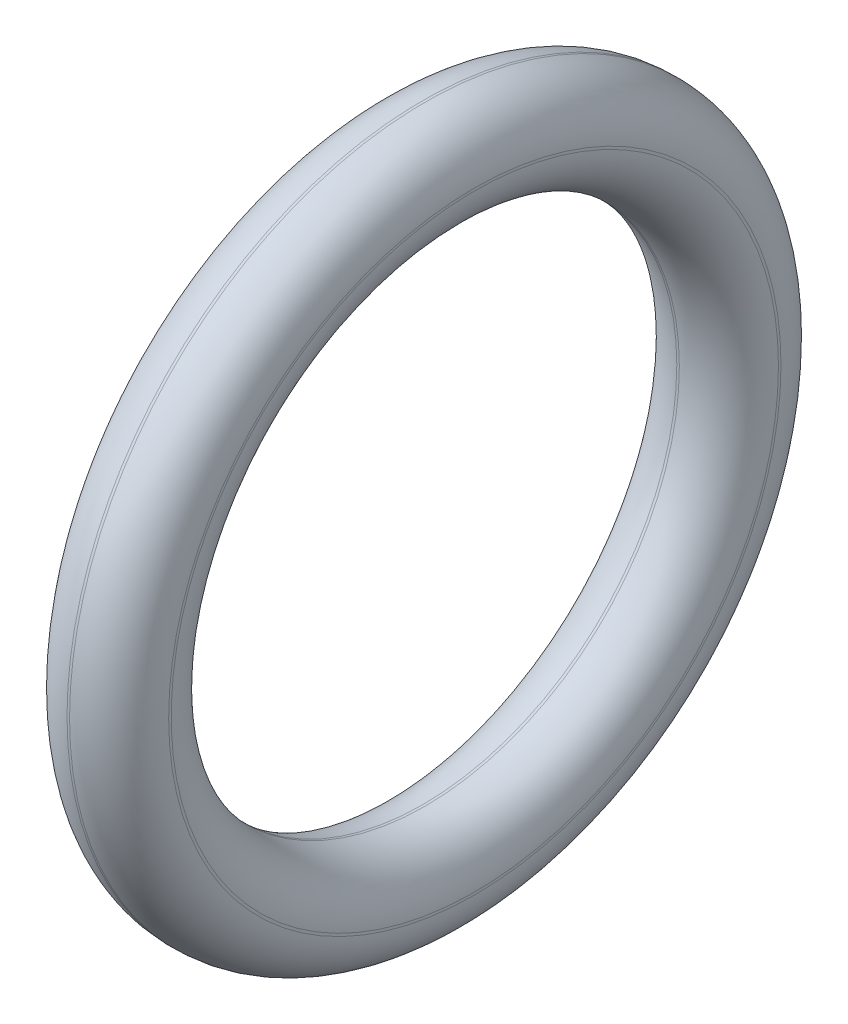
ISO-10303-21;
HEADER;
FILE_DESCRIPTION(('STEP AP214'),'2;1');
FILE_NAME('part.step','',(''),(''),'','','');
FILE_SCHEMA(('AUTOMOTIVE_DESIGN { 1 0 10303 214 1 1 1 1 }'));
ENDSEC;
DATA;
#1=APPLICATION_CONTEXT('core data for automotive mechanical design processes');
#2=APPLICATION_PROTOCOL_DEFINITION('international standard','automotive_design',2000,#1);
#3=PRODUCT_CONTEXT('',#1,'mechanical');
#4=PRODUCT('Part','Part','',(#3));
#5=PRODUCT_RELATED_PRODUCT_CATEGORY('part','',(#4));
#6=PRODUCT_DEFINITION_FORMATION('','',#4);
#7=PRODUCT_DEFINITION_CONTEXT('part definition',#1,'design');
#8=PRODUCT_DEFINITION('design','',#6,#7);
#9=PRODUCT_DEFINITION_SHAPE('','',#8);
#10=(LENGTH_UNIT() NAMED_UNIT(*) SI_UNIT(.MILLI.,.METRE.));
#11=(NAMED_UNIT(*) PLANE_ANGLE_UNIT() SI_UNIT($,.RADIAN.));
#12=(NAMED_UNIT(*) SI_UNIT($,.STERADIAN.) SOLID_ANGLE_UNIT());
#13=UNCERTAINTY_MEASURE_WITH_UNIT(LENGTH_MEASURE(1.E-05),#10,'distance_accuracy_value','');
#14=(GEOMETRIC_REPRESENTATION_CONTEXT(3) GLOBAL_UNCERTAINTY_ASSIGNED_CONTEXT((#13)) GLOBAL_UNIT_ASSIGNED_CONTEXT((#10,
#11,#12)) REPRESENTATION_CONTEXT('',''));
#15=CARTESIAN_POINT('',(0.,0.,0.));
#16=DIRECTION('',(0.,0.,1.));
#17=DIRECTION('',(1.,0.,0.));
#18=AXIS2_PLACEMENT_3D('',#15,#16,#17);
#19=CARTESIAN_POINT('',(0.025,0.,0.));
#20=DIRECTION('',(1.,0.,0.));
#21=DIRECTION('',(0.,0.,-1.));
#22=AXIS2_PLACEMENT_3D('',#19,#20,#21);
#23=TOROIDAL_SURFACE('',#22,6.025,0.975);
#24=CARTESIAN_POINT('',(0.025,0.,0.));
#25=DIRECTION('',(1.,0.,0.));
#26=DIRECTION('',(0.,0.,-1.));
#27=AXIS2_PLACEMENT_3D('',#24,#25,#26);
#28=CIRCLE('',#27,7.);
#29=CARTESIAN_POINT('',(0.025,0.,-7.));
#30=VERTEX_POINT('',#29);
#31=EDGE_CURVE('E10',#30,#30,#28,.T.);
#32=ORIENTED_EDGE('',*,*,#31,.T.);
#33=EDGE_LOOP('',(#32));
#34=FACE_BOUND('',#33,.T.);
#35=CARTESIAN_POINT('',(1.,0.,0.));
#36=DIRECTION('',(1.,0.,0.));
#37=DIRECTION('',(0.,0.,-1.));
#38=AXIS2_PLACEMENT_3D('',#35,#36,#37);
#39=CIRCLE('',#38,6.025);
#40=CARTESIAN_POINT('',(1.,0.,-6.025));
#41=VERTEX_POINT('',#40);
#42=EDGE_CURVE('E376',#41,#41,#39,.T.);
#43=ORIENTED_EDGE('',*,*,#42,.F.);
#44=EDGE_LOOP('',(#43));
#45=FACE_BOUND('',#44,.T.);
#46=ADVANCED_FACE('F348',(#34,#45),#23,.T.);
#47=CARTESIAN_POINT('',(0.,0.,0.));
#48=DIRECTION('',(1.,0.,0.));
#49=DIRECTION('',(0.,0.,-1.));
#50=AXIS2_PLACEMENT_3D('',#47,#48,#49);
#51=CYLINDRICAL_SURFACE('',#50,7.);
#52=CARTESIAN_POINT('',(-0.0250000000000001,0.,0.));
#53=DIRECTION('',(1.,0.,0.));
#54=DIRECTION('',(0.,0.,-1.));
#55=AXIS2_PLACEMENT_3D('',#52,#53,#54);
#56=CIRCLE('',#55,7.);
#57=CARTESIAN_POINT('',(-0.0250000000000001,0.,-7.));
#58=VERTEX_POINT('',#57);
#59=EDGE_CURVE('E354',#58,#58,#56,.T.);
#60=ORIENTED_EDGE('',*,*,#59,.T.);
#61=EDGE_LOOP('',(#60));
#62=FACE_BOUND('',#61,.T.);
#63=ORIENTED_EDGE('',*,*,#31,.F.);
#64=EDGE_LOOP('',(#63));
#65=FACE_BOUND('',#64,.T.);
#66=ADVANCED_FACE('F384',(#62,#65),#51,.T.);
#67=CARTESIAN_POINT('',(-0.025,0.,0.));
#68=DIRECTION('',(1.,0.,0.));
#69=DIRECTION('',(0.,0.,-1.));
#70=AXIS2_PLACEMENT_3D('',#67,#68,#69);
#71=TOROIDAL_SURFACE('',#70,6.025,0.975);
#72=CARTESIAN_POINT('',(-1.,0.,0.));
#73=DIRECTION('',(1.,0.,0.));
#74=DIRECTION('',(0.,0.,-1.));
#75=AXIS2_PLACEMENT_3D('',#72,#73,#74);
#76=CIRCLE('',#75,6.025);
#77=CARTESIAN_POINT('',(-1.,0.,-6.025));
#78=VERTEX_POINT('',#77);
#79=EDGE_CURVE('E358',#78,#78,#76,.T.);
#80=ORIENTED_EDGE('',*,*,#79,.T.);
#81=EDGE_LOOP('',(#80));
#82=FACE_BOUND('',#81,.T.);
#83=ORIENTED_EDGE('',*,*,#59,.F.);
#84=EDGE_LOOP('',(#83));
#85=FACE_BOUND('',#84,.T.);
#86=ADVANCED_FACE('F388',(#82,#85),#71,.T.);
#87=CARTESIAN_POINT('',(-1.,6.025,0.));
#88=DIRECTION('',(-1.,0.,0.));
#89=DIRECTION('',(0.,0.,1.));
#90=AXIS2_PLACEMENT_3D('',#87,#88,#89);
#91=PLANE('',#90);
#92=CARTESIAN_POINT('',(-1.,0.,0.));
#93=DIRECTION('',(1.,0.,0.));
#94=DIRECTION('',(0.,0.,-1.));
#95=AXIS2_PLACEMENT_3D('',#92,#93,#94);
#96=CIRCLE('',#95,5.975);
#97=CARTESIAN_POINT('',(-1.,0.,-5.975));
#98=VERTEX_POINT('',#97);
#99=EDGE_CURVE('E362',#98,#98,#96,.T.);
#100=ORIENTED_EDGE('',*,*,#99,.T.);
#101=EDGE_LOOP('',(#100));
#102=FACE_BOUND('',#101,.T.);
#103=ORIENTED_EDGE('',*,*,#79,.F.);
#104=EDGE_LOOP('',(#103));
#105=FACE_BOUND('',#104,.T.);
#106=ADVANCED_FACE('F392',(#102,#105),#91,.T.);
#107=CARTESIAN_POINT('',(-0.025,0.,0.));
#108=DIRECTION('',(1.,0.,0.));
#109=DIRECTION('',(0.,0.,-1.));
#110=AXIS2_PLACEMENT_3D('',#107,#108,#109);
#111=TOROIDAL_SURFACE('',#110,5.975,0.975);
#112=CARTESIAN_POINT('',(-0.025,0.,0.));
#113=DIRECTION('',(1.,0.,0.));
#114=DIRECTION('',(0.,0.,-1.));
#115=AXIS2_PLACEMENT_3D('',#112,#113,#114);
#116=CIRCLE('',#115,5.);
#117=CARTESIAN_POINT('',(-0.025,0.,-5.));
#118=VERTEX_POINT('',#117);
#119=EDGE_CURVE('E367',#118,#118,#116,.T.);
#120=ORIENTED_EDGE('',*,*,#119,.T.);
#121=EDGE_LOOP('',(#120));
#122=FACE_BOUND('',#121,.T.);
#123=ORIENTED_EDGE('',*,*,#99,.F.);
#124=EDGE_LOOP('',(#123));
#125=FACE_BOUND('',#124,.T.);
#126=ADVANCED_FACE('F399',(#122,#125),#111,.T.);
#127=CARTESIAN_POINT('',(0.,0.,0.));
#128=DIRECTION('',(1.,0.,0.));
#129=DIRECTION('',(0.,0.,-1.));
#130=AXIS2_PLACEMENT_3D('',#127,#128,#129);
#131=CYLINDRICAL_SURFACE('',#130,5.);
#132=CARTESIAN_POINT('',(0.0250000000000002,0.,0.));
#133=DIRECTION('',(1.,0.,0.));
#134=DIRECTION('',(0.,0.,-1.));
#135=AXIS2_PLACEMENT_3D('',#132,#133,#134);
#136=CIRCLE('',#135,5.);
#137=CARTESIAN_POINT('',(0.0250000000000002,0.,-5.));
#138=VERTEX_POINT('',#137);
#139=EDGE_CURVE('E370',#138,#138,#136,.T.);
#140=ORIENTED_EDGE('',*,*,#139,.T.);
#141=EDGE_LOOP('',(#140));
#142=FACE_BOUND('',#141,.T.);
#143=ORIENTED_EDGE('',*,*,#119,.F.);
#144=EDGE_LOOP('',(#143));
#145=FACE_BOUND('',#144,.T.);
#146=ADVANCED_FACE('F403',(#142,#145),#131,.F.);
#147=CARTESIAN_POINT('',(0.025,0.,0.));
#148=DIRECTION('',(1.,0.,0.));
#149=DIRECTION('',(0.,0.,-1.));
#150=AXIS2_PLACEMENT_3D('',#147,#148,#149);
#151=TOROIDAL_SURFACE('',#150,5.975,0.975);
#152=CARTESIAN_POINT('',(1.,0.,0.));
#153=DIRECTION('',(1.,0.,0.));
#154=DIRECTION('',(0.,0.,-1.));
#155=AXIS2_PLACEMENT_3D('',#152,#153,#154);
#156=CIRCLE('',#155,5.975);
#157=CARTESIAN_POINT('',(1.,0.,-5.975));
#158=VERTEX_POINT('',#157);
#159=EDGE_CURVE('E373',#158,#158,#156,.T.);
#160=ORIENTED_EDGE('',*,*,#159,.T.);
#161=EDGE_LOOP('',(#160));
#162=FACE_BOUND('',#161,.T.);
#163=ORIENTED_EDGE('',*,*,#139,.F.);
#164=EDGE_LOOP('',(#163));
#165=FACE_BOUND('',#164,.T.);
#166=ADVANCED_FACE('F407',(#162,#165),#151,.T.);
#167=CARTESIAN_POINT('',(1.,6.025,0.));
#168=DIRECTION('',(1.,0.,0.));
#169=DIRECTION('',(0.,0.,-1.));
#170=AXIS2_PLACEMENT_3D('',#167,#168,#169);
#171=PLANE('',#170);
#172=ORIENTED_EDGE('',*,*,#42,.T.);
#173=EDGE_LOOP('',(#172));
#174=FACE_BOUND('',#173,.T.);
#175=ORIENTED_EDGE('',*,*,#159,.F.);
#176=EDGE_LOOP('',(#175));
#177=FACE_BOUND('',#176,.T.);
#178=ADVANCED_FACE('F380',(#174,#177),#171,.T.);
#179=CLOSED_SHELL('',(#46,#66,#86,#106,#126,#146,#166,#178));
#180=MANIFOLD_SOLID_BREP('B2',#179);
#181=ADVANCED_BREP_SHAPE_REPRESENTATION('',(#18,#180),#14);
#182=SHAPE_DEFINITION_REPRESENTATION(#9,#181);
ENDSEC;
END-ISO-10303-21;
